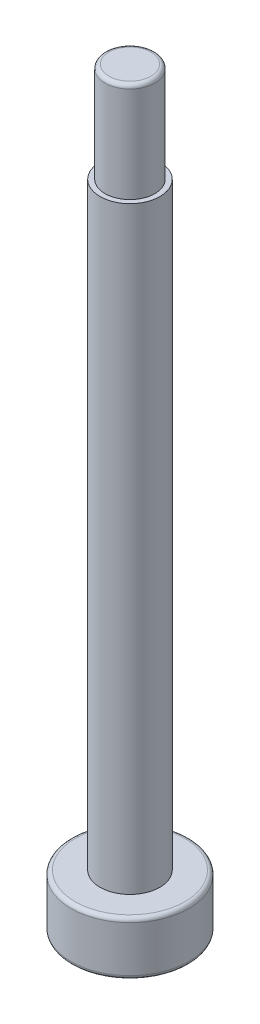
ISO-10303-21;
HEADER;
FILE_DESCRIPTION(('STEP AP214'),'2;1');
FILE_NAME('part.step','',(''),(''),'','','');
FILE_SCHEMA(('AUTOMOTIVE_DESIGN { 1 0 10303 214 1 1 1 1 }'));
ENDSEC;
DATA;
#1=APPLICATION_CONTEXT('core data for automotive mechanical design processes');
#2=APPLICATION_PROTOCOL_DEFINITION('international standard','automotive_design',2000,#1);
#3=PRODUCT_CONTEXT('',#1,'mechanical');
#4=PRODUCT('Part','Part','',(#3));
#5=PRODUCT_RELATED_PRODUCT_CATEGORY('part','',(#4));
#6=PRODUCT_DEFINITION_FORMATION('','',#4);
#7=PRODUCT_DEFINITION_CONTEXT('part definition',#1,'design');
#8=PRODUCT_DEFINITION('design','',#6,#7);
#9=PRODUCT_DEFINITION_SHAPE('','',#8);
#10=(LENGTH_UNIT() NAMED_UNIT(*) SI_UNIT(.MILLI.,.METRE.));
#11=(NAMED_UNIT(*) PLANE_ANGLE_UNIT() SI_UNIT($,.RADIAN.));
#12=(NAMED_UNIT(*) SI_UNIT($,.STERADIAN.) SOLID_ANGLE_UNIT());
#13=UNCERTAINTY_MEASURE_WITH_UNIT(LENGTH_MEASURE(1.E-05),#10,'distance_accuracy_value','');
#14=(GEOMETRIC_REPRESENTATION_CONTEXT(3) GLOBAL_UNCERTAINTY_ASSIGNED_CONTEXT((#13)) GLOBAL_UNIT_ASSIGNED_CONTEXT((#10,
#11,#12)) REPRESENTATION_CONTEXT('',''));
#15=CARTESIAN_POINT('',(0.,0.,0.));
#16=DIRECTION('',(0.,0.,1.));
#17=DIRECTION('',(1.,0.,0.));
#18=AXIS2_PLACEMENT_3D('',#15,#16,#17);
#19=CARTESIAN_POINT('',(0.,2.7,0.));
#20=DIRECTION('',(0.,-1.,0.));
#21=DIRECTION('',(0.,0.,-1.));
#22=AXIS2_PLACEMENT_3D('',#19,#20,#21);
#23=CYLINDRICAL_SURFACE('',#22,2.95);
#24=CARTESIAN_POINT('',(0.,0.2,0.));
#25=DIRECTION('',(0.,1.,0.));
#26=DIRECTION('',(0.,0.,1.));
#27=AXIS2_PLACEMENT_3D('',#24,#25,#26);
#28=CIRCLE('',#27,2.95);
#29=CARTESIAN_POINT('',(0.,0.2,2.95));
#30=VERTEX_POINT('',#29);
#31=EDGE_CURVE('E157',#30,#30,#28,.T.);
#32=ORIENTED_EDGE('',*,*,#31,.T.);
#33=EDGE_LOOP('',(#32));
#34=FACE_BOUND('',#33,.T.);
#35=CARTESIAN_POINT('',(0.,2.5,0.));
#36=DIRECTION('',(0.,1.,0.));
#37=DIRECTION('',(0.,0.,1.));
#38=AXIS2_PLACEMENT_3D('',#35,#36,#37);
#39=CIRCLE('',#38,2.95);
#40=CARTESIAN_POINT('',(0.,2.5,2.95));
#41=VERTEX_POINT('',#40);
#42=EDGE_CURVE('E149',#41,#41,#39,.F.);
#43=ORIENTED_EDGE('',*,*,#42,.T.);
#44=EDGE_LOOP('',(#43));
#45=FACE_BOUND('',#44,.T.);
#46=ADVANCED_FACE('F38',(#34,#45),#23,.T.);
#47=CARTESIAN_POINT('',(0.,2.7,0.));
#48=DIRECTION('',(0.,1.,0.));
#49=DIRECTION('',(0.,0.,1.));
#50=AXIS2_PLACEMENT_3D('',#47,#48,#49);
#51=PLANE('',#50);
#52=CARTESIAN_POINT('',(0.,2.7,0.));
#53=DIRECTION('',(0.,1.,0.));
#54=DIRECTION('',(0.,0.,1.));
#55=AXIS2_PLACEMENT_3D('',#52,#53,#54);
#56=CIRCLE('',#55,2.75);
#57=CARTESIAN_POINT('',(0.,2.7,2.75));
#58=VERTEX_POINT('',#57);
#59=EDGE_CURVE('E163',#58,#58,#56,.T.);
#60=ORIENTED_EDGE('',*,*,#59,.T.);
#61=EDGE_LOOP('',(#60));
#62=FACE_BOUND('',#61,.T.);
#63=CARTESIAN_POINT('',(0.,2.7,0.));
#64=DIRECTION('',(0.,1.,0.));
#65=DIRECTION('',(0.,0.,1.));
#66=AXIS2_PLACEMENT_3D('',#63,#64,#65);
#67=CIRCLE('',#66,1.5);
#68=CARTESIAN_POINT('',(0.,2.7,1.5));
#69=VERTEX_POINT('',#68);
#70=EDGE_CURVE('E150',#69,#69,#67,.T.);
#71=ORIENTED_EDGE('',*,*,#70,.F.);
#72=EDGE_LOOP('',(#71));
#73=FACE_BOUND('',#72,.T.);
#74=ADVANCED_FACE('F180',(#62,#73),#51,.T.);
#75=CARTESIAN_POINT('',(0.,0.,0.));
#76=DIRECTION('',(0.,1.,0.));
#77=DIRECTION('',(0.,0.,1.));
#78=AXIS2_PLACEMENT_3D('',#75,#76,#77);
#79=PLANE('',#78);
#80=CARTESIAN_POINT('',(0.,0.,0.));
#81=DIRECTION('',(0.,1.,0.));
#82=DIRECTION('',(0.,0.,1.));
#83=AXIS2_PLACEMENT_3D('',#80,#81,#82);
#84=CIRCLE('',#83,2.75);
#85=CARTESIAN_POINT('',(0.,0.,2.75));
#86=VERTEX_POINT('',#85);
#87=EDGE_CURVE('E160',#86,#86,#84,.F.);
#88=ORIENTED_EDGE('',*,*,#87,.T.);
#89=EDGE_LOOP('',(#88));
#90=FACE_BOUND('',#89,.T.);
#91=DIRECTION('',(-0.28704549437819,0.,0.95791695055322));
#92=VECTOR('',#91,1.);
#93=CARTESIAN_POINT('',(2.24728548800427,0.,-0.532016229770034));
#94=LINE('',#93,#92);
#95=CARTESIAN_POINT('',(2.24728548800427,0.,-0.532016229770034));
#96=VERTEX_POINT('',#95);
#97=CARTESIAN_POINT('',(1.58438231420861,0.,1.68019820728279));
#98=VERTEX_POINT('',#97);
#99=EDGE_CURVE('E127',#96,#98,#94,.T.);
#100=ORIENTED_EDGE('',*,*,#99,.F.);
#101=DIRECTION('',(0.686057666705715,0.,0.727547165449986));
#102=VECTOR('',#101,1.);
#103=CARTESIAN_POINT('',(0.662903173795668,0.,-2.21221443705283));
#104=LINE('',#103,#102);
#105=CARTESIAN_POINT('',(0.662903173795668,0.,-2.21221443705283));
#106=VERTEX_POINT('',#105);
#107=EDGE_CURVE('E53',#106,#96,#104,.T.);
#108=ORIENTED_EDGE('',*,*,#107,.F.);
#109=DIRECTION('',(0.973103161083906,0.,-0.230369785103234));
#110=VECTOR('',#109,1.);
#111=CARTESIAN_POINT('',(-1.58438231420861,0.,-1.68019820728279));
#112=LINE('',#111,#110);
#113=CARTESIAN_POINT('',(-1.58438231420861,0.,-1.68019820728279));
#114=VERTEX_POINT('',#113);
#115=EDGE_CURVE('E136',#114,#106,#112,.T.);
#116=ORIENTED_EDGE('',*,*,#115,.F.);
#117=DIRECTION('',(0.28704549437819,0.,-0.95791695055322));
#118=VECTOR('',#117,1.);
#119=CARTESIAN_POINT('',(-2.24728548800427,0.,0.532016229770034));
#120=LINE('',#119,#118);
#121=CARTESIAN_POINT('',(-2.24728548800427,0.,0.532016229770034));
#122=VERTEX_POINT('',#121);
#123=EDGE_CURVE('E134',#122,#114,#120,.T.);
#124=ORIENTED_EDGE('',*,*,#123,.F.);
#125=DIRECTION('',(-0.686057666705716,0.,-0.727547165449986));
#126=VECTOR('',#125,1.);
#127=CARTESIAN_POINT('',(-0.662903173795669,0.,2.21221443705283));
#128=LINE('',#127,#126);
#129=CARTESIAN_POINT('',(-0.662903173795669,0.,2.21221443705283));
#130=VERTEX_POINT('',#129);
#131=EDGE_CURVE('E101',#130,#122,#128,.T.);
#132=ORIENTED_EDGE('',*,*,#131,.F.);
#133=DIRECTION('',(-0.973103161083906,0.,0.230369785103234));
#134=VECTOR('',#133,1.);
#135=CARTESIAN_POINT('',(1.58438231420861,0.,1.68019820728279));
#136=LINE('',#135,#134);
#137=EDGE_CURVE('E130',#98,#130,#136,.T.);
#138=ORIENTED_EDGE('',*,*,#137,.F.);
#139=EDGE_LOOP('',(#100,#108,#116,#124,#132,#138));
#140=FACE_BOUND('',#139,.T.);
#141=ADVANCED_FACE('F186',(#90,#140),#79,.F.);
#142=CARTESIAN_POINT('',(0.,32.7,0.));
#143=DIRECTION('',(0.,-1.,0.));
#144=DIRECTION('',(0.,0.,-1.));
#145=AXIS2_PLACEMENT_3D('',#142,#143,#144);
#146=CYLINDRICAL_SURFACE('',#145,1.5);
#147=CARTESIAN_POINT('',(0.,32.7,0.));
#148=DIRECTION('',(0.,1.,0.));
#149=DIRECTION('',(0.,0.,1.));
#150=AXIS2_PLACEMENT_3D('',#147,#148,#149);
#151=CIRCLE('',#150,1.5);
#152=CARTESIAN_POINT('',(0.,32.7,1.5));
#153=VERTEX_POINT('',#152);
#154=EDGE_CURVE('E140',#153,#153,#151,.T.);
#155=ORIENTED_EDGE('',*,*,#154,.F.);
#156=EDGE_LOOP('',(#155));
#157=FACE_BOUND('',#156,.T.);
#158=ORIENTED_EDGE('',*,*,#70,.T.);
#159=EDGE_LOOP('',(#158));
#160=FACE_BOUND('',#159,.T.);
#161=ADVANCED_FACE('F205',(#157,#160),#146,.T.);
#162=CARTESIAN_POINT('',(0.,32.7,0.));
#163=DIRECTION('',(0.,1.,0.));
#164=DIRECTION('',(0.,0.,1.));
#165=AXIS2_PLACEMENT_3D('',#162,#163,#164);
#166=PLANE('',#165);
#167=CARTESIAN_POINT('',(0.,32.7,0.));
#168=DIRECTION('',(0.,1.,0.));
#169=DIRECTION('',(0.,0.,1.));
#170=AXIS2_PLACEMENT_3D('',#167,#168,#169);
#171=CIRCLE('',#170,1.25);
#172=CARTESIAN_POINT('',(0.,32.7,1.25));
#173=VERTEX_POINT('',#172);
#174=EDGE_CURVE('E146',#173,#173,#171,.T.);
#175=ORIENTED_EDGE('',*,*,#174,.F.);
#176=EDGE_LOOP('',(#175));
#177=FACE_BOUND('',#176,.T.);
#178=ORIENTED_EDGE('',*,*,#154,.T.);
#179=EDGE_LOOP('',(#178));
#180=FACE_BOUND('',#179,.T.);
#181=ADVANCED_FACE('F227',(#177,#180),#166,.T.);
#182=CARTESIAN_POINT('',(0.,37.7,0.));
#183=DIRECTION('',(0.,-1.,0.));
#184=DIRECTION('',(0.,0.,-1.));
#185=AXIS2_PLACEMENT_3D('',#182,#183,#184);
#186=CYLINDRICAL_SURFACE('',#185,1.25);
#187=CARTESIAN_POINT('',(0.,37.5,0.));
#188=DIRECTION('',(0.,1.,0.));
#189=DIRECTION('',(0.,0.,1.));
#190=AXIS2_PLACEMENT_3D('',#187,#188,#189);
#191=CIRCLE('',#190,1.25);
#192=CARTESIAN_POINT('',(0.,37.5,1.25));
#193=VERTEX_POINT('',#192);
#194=EDGE_CURVE('E11',#193,#193,#191,.F.);
#195=ORIENTED_EDGE('',*,*,#194,.T.);
#196=EDGE_LOOP('',(#195));
#197=FACE_BOUND('',#196,.T.);
#198=ORIENTED_EDGE('',*,*,#174,.T.);
#199=EDGE_LOOP('',(#198));
#200=FACE_BOUND('',#199,.T.);
#201=ADVANCED_FACE('F220',(#197,#200),#186,.T.);
#202=CARTESIAN_POINT('',(0.,37.7,0.));
#203=DIRECTION('',(0.,1.,0.));
#204=DIRECTION('',(0.,0.,1.));
#205=AXIS2_PLACEMENT_3D('',#202,#203,#204);
#206=PLANE('',#205);
#207=CARTESIAN_POINT('',(0.,37.7,0.));
#208=DIRECTION('',(0.,1.,0.));
#209=DIRECTION('',(0.,0.,1.));
#210=AXIS2_PLACEMENT_3D('',#207,#208,#209);
#211=CIRCLE('',#210,1.05);
#212=CARTESIAN_POINT('',(0.,37.7,1.05));
#213=VERTEX_POINT('',#212);
#214=EDGE_CURVE('E46',#213,#213,#211,.T.);
#215=ORIENTED_EDGE('',*,*,#214,.T.);
#216=EDGE_LOOP('',(#215));
#217=FACE_BOUND('',#216,.T.);
#218=ADVANCED_FACE('F168',(#217),#206,.T.);
#219=CARTESIAN_POINT('',(0.662903173795668,2.,-2.21221443705283));
#220=DIRECTION('',(0.727547165449986,0.,-0.686057666705715));
#221=DIRECTION('',(-0.686057666705716,0.,-0.727547165449986));
#222=AXIS2_PLACEMENT_3D('',#219,#220,#221);
#223=PLANE('',#222);
#224=ORIENTED_EDGE('',*,*,#107,.T.);
#225=DIRECTION('',(0.,-1.,0.));
#226=VECTOR('',#225,1.);
#227=CARTESIAN_POINT('',(2.24728548800427,2.,-0.532016229770034));
#228=LINE('',#227,#226);
#229=CARTESIAN_POINT('',(2.24728548800427,2.,-0.532016229770034));
#230=VERTEX_POINT('',#229);
#231=EDGE_CURVE('E83',#230,#96,#228,.T.);
#232=ORIENTED_EDGE('',*,*,#231,.F.);
#233=DIRECTION('',(0.686057666705715,0.,0.727547165449986));
#234=VECTOR('',#233,1.);
#235=CARTESIAN_POINT('',(0.662903173795668,2.,-2.21221443705283));
#236=LINE('',#235,#234);
#237=CARTESIAN_POINT('',(0.662903173795668,2.,-2.21221443705283));
#238=VERTEX_POINT('',#237);
#239=EDGE_CURVE('E138',#238,#230,#236,.T.);
#240=ORIENTED_EDGE('',*,*,#239,.F.);
#241=DIRECTION('',(0.,-1.,0.));
#242=VECTOR('',#241,1.);
#243=CARTESIAN_POINT('',(0.662903173795668,2.,-2.21221443705283));
#244=LINE('',#243,#242);
#245=EDGE_CURVE('E61',#238,#106,#244,.T.);
#246=ORIENTED_EDGE('',*,*,#245,.T.);
#247=EDGE_LOOP('',(#224,#232,#240,#246));
#248=FACE_BOUND('',#247,.T.);
#249=ADVANCED_FACE('F211',(#248),#223,.F.);
#250=CARTESIAN_POINT('',(-1.58438231420861,2.,-1.68019820728279));
#251=DIRECTION('',(-0.230369785103234,0.,-0.973103161083906));
#252=DIRECTION('',(-0.973103161083906,0.,0.230369785103234));
#253=AXIS2_PLACEMENT_3D('',#250,#251,#252);
#254=PLANE('',#253);
#255=ORIENTED_EDGE('',*,*,#115,.T.);
#256=ORIENTED_EDGE('',*,*,#245,.F.);
#257=DIRECTION('',(0.973103161083906,0.,-0.230369785103234));
#258=VECTOR('',#257,1.);
#259=CARTESIAN_POINT('',(-1.58438231420861,2.,-1.68019820728279));
#260=LINE('',#259,#258);
#261=CARTESIAN_POINT('',(-1.58438231420861,2.,-1.68019820728279));
#262=VERTEX_POINT('',#261);
#263=EDGE_CURVE('E113',#262,#238,#260,.T.);
#264=ORIENTED_EDGE('',*,*,#263,.F.);
#265=DIRECTION('',(0.,-1.,0.));
#266=VECTOR('',#265,1.);
#267=CARTESIAN_POINT('',(-1.58438231420861,2.,-1.68019820728279));
#268=LINE('',#267,#266);
#269=EDGE_CURVE('E105',#262,#114,#268,.T.);
#270=ORIENTED_EDGE('',*,*,#269,.T.);
#271=EDGE_LOOP('',(#255,#256,#264,#270));
#272=FACE_BOUND('',#271,.T.);
#273=ADVANCED_FACE('F213',(#272),#254,.F.);
#274=CARTESIAN_POINT('',(-2.24728548800427,2.,0.532016229770034));
#275=DIRECTION('',(-0.95791695055322,0.,-0.28704549437819));
#276=DIRECTION('',(-0.28704549437819,0.,0.95791695055322));
#277=AXIS2_PLACEMENT_3D('',#274,#275,#276);
#278=PLANE('',#277);
#279=ORIENTED_EDGE('',*,*,#123,.T.);
#280=ORIENTED_EDGE('',*,*,#269,.F.);
#281=DIRECTION('',(0.28704549437819,0.,-0.95791695055322));
#282=VECTOR('',#281,1.);
#283=CARTESIAN_POINT('',(-2.24728548800427,2.,0.532016229770034));
#284=LINE('',#283,#282);
#285=CARTESIAN_POINT('',(-2.24728548800427,2.,0.532016229770034));
#286=VERTEX_POINT('',#285);
#287=EDGE_CURVE('E109',#286,#262,#284,.T.);
#288=ORIENTED_EDGE('',*,*,#287,.F.);
#289=DIRECTION('',(0.,-1.,0.));
#290=VECTOR('',#289,1.);
#291=CARTESIAN_POINT('',(-2.24728548800427,2.,0.532016229770034));
#292=LINE('',#291,#290);
#293=EDGE_CURVE('E94',#286,#122,#292,.T.);
#294=ORIENTED_EDGE('',*,*,#293,.T.);
#295=EDGE_LOOP('',(#279,#280,#288,#294));
#296=FACE_BOUND('',#295,.T.);
#297=ADVANCED_FACE('F110',(#296),#278,.F.);
#298=CARTESIAN_POINT('',(-0.662903173795669,2.,2.21221443705283));
#299=DIRECTION('',(-0.727547165449986,0.,0.686057666705716));
#300=DIRECTION('',(0.686057666705716,0.,0.727547165449986));
#301=AXIS2_PLACEMENT_3D('',#298,#299,#300);
#302=PLANE('',#301);
#303=ORIENTED_EDGE('',*,*,#131,.T.);
#304=ORIENTED_EDGE('',*,*,#293,.F.);
#305=DIRECTION('',(-0.686057666705716,0.,-0.727547165449986));
#306=VECTOR('',#305,1.);
#307=CARTESIAN_POINT('',(-0.662903173795669,2.,2.21221443705283));
#308=LINE('',#307,#306);
#309=CARTESIAN_POINT('',(-0.662903173795669,2.,2.21221443705283));
#310=VERTEX_POINT('',#309);
#311=EDGE_CURVE('E98',#310,#286,#308,.T.);
#312=ORIENTED_EDGE('',*,*,#311,.F.);
#313=DIRECTION('',(0.,-1.,0.));
#314=VECTOR('',#313,1.);
#315=CARTESIAN_POINT('',(-0.662903173795669,2.,2.21221443705283));
#316=LINE('',#315,#314);
#317=EDGE_CURVE('E106',#310,#130,#316,.T.);
#318=ORIENTED_EDGE('',*,*,#317,.T.);
#319=EDGE_LOOP('',(#303,#304,#312,#318));
#320=FACE_BOUND('',#319,.T.);
#321=ADVANCED_FACE('F96',(#320),#302,.F.);
#322=CARTESIAN_POINT('',(1.58438231420861,2.,1.68019820728279));
#323=DIRECTION('',(0.230369785103234,0.,0.973103161083906));
#324=DIRECTION('',(0.973103161083906,0.,-0.230369785103234));
#325=AXIS2_PLACEMENT_3D('',#322,#323,#324);
#326=PLANE('',#325);
#327=ORIENTED_EDGE('',*,*,#137,.T.);
#328=ORIENTED_EDGE('',*,*,#317,.F.);
#329=DIRECTION('',(-0.973103161083906,0.,0.230369785103234));
#330=VECTOR('',#329,1.);
#331=CARTESIAN_POINT('',(1.58438231420861,2.,1.68019820728279));
#332=LINE('',#331,#330);
#333=CARTESIAN_POINT('',(1.58438231420861,2.,1.68019820728279));
#334=VERTEX_POINT('',#333);
#335=EDGE_CURVE('E119',#334,#310,#332,.T.);
#336=ORIENTED_EDGE('',*,*,#335,.F.);
#337=DIRECTION('',(0.,-1.,0.));
#338=VECTOR('',#337,1.);
#339=CARTESIAN_POINT('',(1.58438231420861,2.,1.68019820728279));
#340=LINE('',#339,#338);
#341=EDGE_CURVE('E143',#334,#98,#340,.T.);
#342=ORIENTED_EDGE('',*,*,#341,.T.);
#343=EDGE_LOOP('',(#327,#328,#336,#342));
#344=FACE_BOUND('',#343,.T.);
#345=ADVANCED_FACE('F285',(#344),#326,.F.);
#346=CARTESIAN_POINT('',(2.24728548800427,2.,-0.532016229770034));
#347=DIRECTION('',(0.95791695055322,0.,0.28704549437819));
#348=DIRECTION('',(0.28704549437819,0.,-0.95791695055322));
#349=AXIS2_PLACEMENT_3D('',#346,#347,#348);
#350=PLANE('',#349);
#351=ORIENTED_EDGE('',*,*,#99,.T.);
#352=ORIENTED_EDGE('',*,*,#341,.F.);
#353=DIRECTION('',(-0.28704549437819,0.,0.95791695055322));
#354=VECTOR('',#353,1.);
#355=CARTESIAN_POINT('',(2.24728548800427,2.,-0.532016229770034));
#356=LINE('',#355,#354);
#357=EDGE_CURVE('E121',#230,#334,#356,.T.);
#358=ORIENTED_EDGE('',*,*,#357,.F.);
#359=ORIENTED_EDGE('',*,*,#231,.T.);
#360=EDGE_LOOP('',(#351,#352,#358,#359));
#361=FACE_BOUND('',#360,.T.);
#362=ADVANCED_FACE('F197',(#361),#350,.F.);
#363=CARTESIAN_POINT('',(0.,2.,0.));
#364=DIRECTION('',(0.,-1.,0.));
#365=DIRECTION('',(0.,0.,-1.));
#366=AXIS2_PLACEMENT_3D('',#363,#364,#365);
#367=PLANE('',#366);
#368=ORIENTED_EDGE('',*,*,#239,.T.);
#369=ORIENTED_EDGE('',*,*,#357,.T.);
#370=ORIENTED_EDGE('',*,*,#335,.T.);
#371=ORIENTED_EDGE('',*,*,#311,.T.);
#372=ORIENTED_EDGE('',*,*,#287,.T.);
#373=ORIENTED_EDGE('',*,*,#263,.T.);
#374=EDGE_LOOP('',(#368,#369,#370,#371,#372,#373));
#375=FACE_BOUND('',#374,.T.);
#376=ADVANCED_FACE('F116',(#375),#367,.T.);
#377=CARTESIAN_POINT('',(0.,0.2,0.));
#378=DIRECTION('',(0.,1.,0.));
#379=DIRECTION('',(0.,0.,1.));
#380=AXIS2_PLACEMENT_3D('',#377,#378,#379);
#381=TOROIDAL_SURFACE('',#380,2.75,0.2);
#382=ORIENTED_EDGE('',*,*,#87,.F.);
#383=EDGE_LOOP('',(#382));
#384=FACE_BOUND('',#383,.T.);
#385=ORIENTED_EDGE('',*,*,#31,.F.);
#386=EDGE_LOOP('',(#385));
#387=FACE_BOUND('',#386,.T.);
#388=ADVANCED_FACE('F176',(#384,#387),#381,.T.);
#389=CARTESIAN_POINT('',(0.,2.5,0.));
#390=DIRECTION('',(0.,1.,0.));
#391=DIRECTION('',(0.,0.,1.));
#392=AXIS2_PLACEMENT_3D('',#389,#390,#391);
#393=TOROIDAL_SURFACE('',#392,2.75,0.2);
#394=ORIENTED_EDGE('',*,*,#42,.F.);
#395=EDGE_LOOP('',(#394));
#396=FACE_BOUND('',#395,.T.);
#397=ORIENTED_EDGE('',*,*,#59,.F.);
#398=EDGE_LOOP('',(#397));
#399=FACE_BOUND('',#398,.T.);
#400=ADVANCED_FACE('F171',(#396,#399),#393,.T.);
#401=CARTESIAN_POINT('',(0.,37.5,0.));
#402=DIRECTION('',(0.,1.,0.));
#403=DIRECTION('',(0.,0.,1.));
#404=AXIS2_PLACEMENT_3D('',#401,#402,#403);
#405=TOROIDAL_SURFACE('',#404,1.05,0.2);
#406=ORIENTED_EDGE('',*,*,#194,.F.);
#407=EDGE_LOOP('',(#406));
#408=FACE_BOUND('',#407,.T.);
#409=ORIENTED_EDGE('',*,*,#214,.F.);
#410=EDGE_LOOP('',(#409));
#411=FACE_BOUND('',#410,.T.);
#412=ADVANCED_FACE('F40',(#408,#411),#405,.T.);
#413=CLOSED_SHELL('',(#46,#74,#141,#161,#181,#201,#218,#249,#273,#297,#321,#345,#362,#376,#388,
#400,#412));
#414=MANIFOLD_SOLID_BREP('B2',#413);
#415=ADVANCED_BREP_SHAPE_REPRESENTATION('',(#18,#414),#14);
#416=SHAPE_DEFINITION_REPRESENTATION(#9,#415);
ENDSEC;
END-ISO-10303-21;
